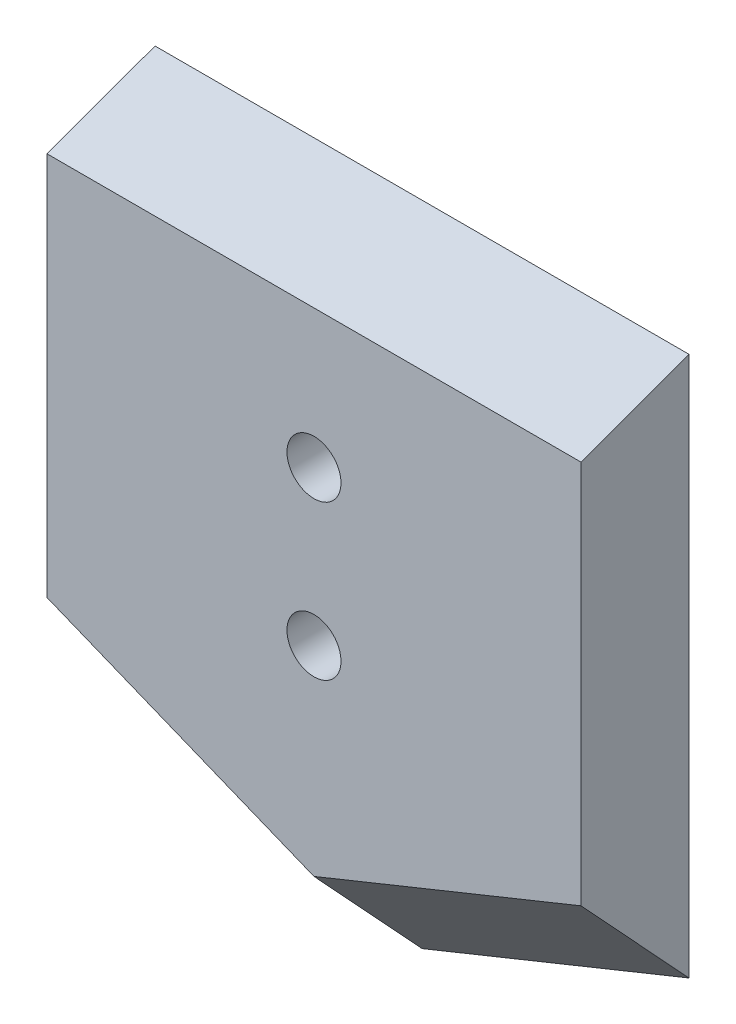
ISO-10303-21;
HEADER;
FILE_DESCRIPTION(('STEP AP214'),'2;1');
FILE_NAME('part.step','',(''),(''),'','','');
FILE_SCHEMA(('AUTOMOTIVE_DESIGN { 1 0 10303 214 1 1 1 1 }'));
ENDSEC;
DATA;
#1=APPLICATION_CONTEXT('core data for automotive mechanical design processes');
#2=APPLICATION_PROTOCOL_DEFINITION('international standard','automotive_design',2000,#1);
#3=PRODUCT_CONTEXT('',#1,'mechanical');
#4=PRODUCT('Part','Part','',(#3));
#5=PRODUCT_RELATED_PRODUCT_CATEGORY('part','',(#4));
#6=PRODUCT_DEFINITION_FORMATION('','',#4);
#7=PRODUCT_DEFINITION_CONTEXT('part definition',#1,'design');
#8=PRODUCT_DEFINITION('design','',#6,#7);
#9=PRODUCT_DEFINITION_SHAPE('','',#8);
#10=(LENGTH_UNIT() NAMED_UNIT(*) SI_UNIT(.MILLI.,.METRE.));
#11=(NAMED_UNIT(*) PLANE_ANGLE_UNIT() SI_UNIT($,.RADIAN.));
#12=(NAMED_UNIT(*) SI_UNIT($,.STERADIAN.) SOLID_ANGLE_UNIT());
#13=UNCERTAINTY_MEASURE_WITH_UNIT(LENGTH_MEASURE(1.E-05),#10,'distance_accuracy_value','');
#14=(GEOMETRIC_REPRESENTATION_CONTEXT(3) GLOBAL_UNCERTAINTY_ASSIGNED_CONTEXT((#13)) GLOBAL_UNIT_ASSIGNED_CONTEXT((#10,
#11,#12)) REPRESENTATION_CONTEXT('',''));
#15=CARTESIAN_POINT('',(0.,0.,0.));
#16=DIRECTION('',(0.,0.,1.));
#17=DIRECTION('',(1.,0.,0.));
#18=AXIS2_PLACEMENT_3D('',#15,#16,#17);
#19=CARTESIAN_POINT('',(0.,-6.,0.));
#20=DIRECTION('',(0.,0.,1.));
#21=DIRECTION('',(1.,0.,0.));
#22=AXIS2_PLACEMENT_3D('',#19,#20,#21);
#23=CYLINDRICAL_SURFACE('',#22,1.75);
#24=CARTESIAN_POINT('',(0.,-6.,7.));
#25=DIRECTION('',(0.,0.,1.));
#26=DIRECTION('',(-1.,0.,0.));
#27=AXIS2_PLACEMENT_3D('',#24,#25,#26);
#28=CIRCLE('',#27,1.75);
#29=CARTESIAN_POINT('',(-1.75,-6.,7.));
#30=VERTEX_POINT('',#29);
#31=EDGE_CURVE('E117',#30,#30,#28,.T.);
#32=ORIENTED_EDGE('',*,*,#31,.T.);
#33=EDGE_LOOP('',(#32));
#34=FACE_BOUND('',#33,.T.);
#35=CARTESIAN_POINT('',(0.,-6.,3.));
#36=DIRECTION('',(0.,0.,-1.));
#37=DIRECTION('',(-1.,0.,0.));
#38=AXIS2_PLACEMENT_3D('',#35,#36,#37);
#39=CIRCLE('',#38,1.75);
#40=CARTESIAN_POINT('',(-1.75,-6.,3.));
#41=VERTEX_POINT('',#40);
#42=EDGE_CURVE('E39',#41,#41,#39,.F.);
#43=ORIENTED_EDGE('',*,*,#42,.F.);
#44=EDGE_LOOP('',(#43));
#45=FACE_BOUND('',#44,.T.);
#46=ADVANCED_FACE('F35',(#34,#45),#23,.F.);
#47=CARTESIAN_POINT('',(0.,4.,0.));
#48=DIRECTION('',(0.,0.,1.));
#49=DIRECTION('',(1.,0.,0.));
#50=AXIS2_PLACEMENT_3D('',#47,#48,#49);
#51=CYLINDRICAL_SURFACE('',#50,1.75);
#52=CARTESIAN_POINT('',(0.,4.,7.));
#53=DIRECTION('',(0.,0.,1.));
#54=DIRECTION('',(-1.,0.,0.));
#55=AXIS2_PLACEMENT_3D('',#52,#53,#54);
#56=CIRCLE('',#55,1.75);
#57=CARTESIAN_POINT('',(-1.75,4.,7.));
#58=VERTEX_POINT('',#57);
#59=EDGE_CURVE('E121',#58,#58,#56,.T.);
#60=ORIENTED_EDGE('',*,*,#59,.T.);
#61=EDGE_LOOP('',(#60));
#62=FACE_BOUND('',#61,.T.);
#63=CARTESIAN_POINT('',(0.,4.,3.));
#64=DIRECTION('',(0.,0.,-1.));
#65=DIRECTION('',(-1.,0.,0.));
#66=AXIS2_PLACEMENT_3D('',#63,#64,#65);
#67=CIRCLE('',#66,1.75);
#68=CARTESIAN_POINT('',(-1.75,4.,3.));
#69=VERTEX_POINT('',#68);
#70=EDGE_CURVE('E119',#69,#69,#67,.F.);
#71=ORIENTED_EDGE('',*,*,#70,.F.);
#72=EDGE_LOOP('',(#71));
#73=FACE_BOUND('',#72,.T.);
#74=ADVANCED_FACE('F162',(#62,#73),#51,.F.);
#75=CARTESIAN_POINT('',(17.3,13.,7.));
#76=DIRECTION('',(-1.,0.,0.));
#77=DIRECTION('',(0.,0.,1.));
#78=AXIS2_PLACEMENT_3D('',#75,#76,#77);
#79=PLANE('',#78);
#80=DIRECTION('',(0.,1.,0.));
#81=VECTOR('',#80,1.);
#82=CARTESIAN_POINT('',(17.3,13.,0.));
#83=LINE('',#82,#81);
#84=CARTESIAN_POINT('',(17.3,-19.5,0.));
#85=VERTEX_POINT('',#84);
#86=CARTESIAN_POINT('',(17.3,15.5,0.));
#87=VERTEX_POINT('',#86);
#88=EDGE_CURVE('E94',#85,#87,#83,.T.);
#89=ORIENTED_EDGE('',*,*,#88,.T.);
#90=DIRECTION('',(0.,0.342020143325666,-0.939692620785909));
#91=VECTOR('',#90,1.);
#92=CARTESIAN_POINT('',(17.3,15.5,0.));
#93=LINE('',#92,#91);
#94=CARTESIAN_POINT('',(17.3,12.9522083601366,7.));
#95=VERTEX_POINT('',#94);
#96=EDGE_CURVE('E59',#87,#95,#93,.F.);
#97=ORIENTED_EDGE('',*,*,#96,.T.);
#98=DIRECTION('',(0.,1.,0.));
#99=VECTOR('',#98,1.);
#100=CARTESIAN_POINT('',(17.3,13.,7.));
#101=LINE('',#100,#99);
#102=CARTESIAN_POINT('',(17.3,-11.9486875651011,7.));
#103=VERTEX_POINT('',#102);
#104=EDGE_CURVE('E93',#103,#95,#101,.T.);
#105=ORIENTED_EDGE('',*,*,#104,.F.);
#106=DIRECTION('',(0.,0.733371095333155,0.679828534654032));
#107=VECTOR('',#106,1.);
#108=CARTESIAN_POINT('',(17.3,-19.5,0.));
#109=LINE('',#108,#107);
#110=EDGE_CURVE('E109',#103,#85,#109,.F.);
#111=ORIENTED_EDGE('',*,*,#110,.T.);
#112=EDGE_LOOP('',(#89,#97,#105,#111));
#113=FACE_BOUND('',#112,.T.);
#114=ADVANCED_FACE('F150',(#113),#79,.F.);
#115=CARTESIAN_POINT('',(-17.3,13.,7.));
#116=DIRECTION('',(1.,0.,0.));
#117=DIRECTION('',(0.,1.,0.));
#118=AXIS2_PLACEMENT_3D('',#115,#116,#117);
#119=PLANE('',#118);
#120=DIRECTION('',(0.,-1.,0.));
#121=VECTOR('',#120,1.);
#122=CARTESIAN_POINT('',(-17.3,13.,7.));
#123=LINE('',#122,#121);
#124=CARTESIAN_POINT('',(-17.3,12.9522083601366,7.));
#125=VERTEX_POINT('',#124);
#126=CARTESIAN_POINT('',(-17.3,-11.9486875651011,7.));
#127=VERTEX_POINT('',#126);
#128=EDGE_CURVE('E143',#125,#127,#123,.T.);
#129=ORIENTED_EDGE('',*,*,#128,.F.);
#130=DIRECTION('',(0.,-0.342020143325666,0.939692620785909));
#131=VECTOR('',#130,1.);
#132=CARTESIAN_POINT('',(-17.3,15.5,0.));
#133=LINE('',#132,#131);
#134=CARTESIAN_POINT('',(-17.3,15.5,0.));
#135=VERTEX_POINT('',#134);
#136=EDGE_CURVE('E11',#125,#135,#133,.F.);
#137=ORIENTED_EDGE('',*,*,#136,.T.);
#138=DIRECTION('',(0.,-1.,0.));
#139=VECTOR('',#138,1.);
#140=CARTESIAN_POINT('',(-17.3,13.,0.));
#141=LINE('',#140,#139);
#142=CARTESIAN_POINT('',(-17.3,-19.5,0.));
#143=VERTEX_POINT('',#142);
#144=EDGE_CURVE('E83',#135,#143,#141,.T.);
#145=ORIENTED_EDGE('',*,*,#144,.T.);
#146=DIRECTION('',(0.,-0.733371095333155,-0.679828534654032));
#147=VECTOR('',#146,1.);
#148=CARTESIAN_POINT('',(-17.3,-23.2648321442911,-3.48996617968573));
#149=LINE('',#148,#147);
#150=EDGE_CURVE('E87',#143,#127,#149,.F.);
#151=ORIENTED_EDGE('',*,*,#150,.T.);
#152=EDGE_LOOP('',(#129,#137,#145,#151));
#153=FACE_BOUND('',#152,.T.);
#154=ADVANCED_FACE('F85',(#153),#119,.F.);
#155=CARTESIAN_POINT('',(0.,0.,7.));
#156=DIRECTION('',(0.,0.,1.));
#157=DIRECTION('',(1.,0.,0.));
#158=AXIS2_PLACEMENT_3D('',#155,#156,#157);
#159=PLANE('',#158);
#160=ORIENTED_EDGE('',*,*,#59,.F.);
#161=EDGE_LOOP('',(#160));
#162=FACE_BOUND('',#161,.T.);
#163=ORIENTED_EDGE('',*,*,#31,.F.);
#164=EDGE_LOOP('',(#163));
#165=FACE_BOUND('',#164,.T.);
#166=ORIENTED_EDGE('',*,*,#104,.T.);
#167=DIRECTION('',(-1.,0.,0.));
#168=VECTOR('',#167,1.);
#169=CARTESIAN_POINT('',(0.,12.9522083601366,7.));
#170=LINE('',#169,#168);
#171=EDGE_CURVE('E44',#95,#125,#170,.T.);
#172=ORIENTED_EDGE('',*,*,#171,.T.);
#173=ORIENTED_EDGE('',*,*,#128,.T.);
#174=DIRECTION('',(0.926991176745522,-0.375083135099344,0.));
#175=VECTOR('',#174,1.);
#176=CARTESIAN_POINT('',(-6.5884351090578,-16.2828467695286,7.));
#177=LINE('',#176,#175);
#178=CARTESIAN_POINT('',(0.,-18.9486875651011,7.));
#179=VERTEX_POINT('',#178);
#180=EDGE_CURVE('E108',#127,#179,#177,.T.);
#181=ORIENTED_EDGE('',*,*,#180,.T.);
#182=DIRECTION('',(0.926991176745522,0.375083135099344,0.));
#183=VECTOR('',#182,1.);
#184=CARTESIAN_POINT('',(6.5884351090578,-16.2828467695286,7.));
#185=LINE('',#184,#183);
#186=EDGE_CURVE('E112',#179,#103,#185,.T.);
#187=ORIENTED_EDGE('',*,*,#186,.T.);
#188=EDGE_LOOP('',(#166,#172,#173,#181,#187));
#189=FACE_BOUND('',#188,.T.);
#190=ADVANCED_FACE('F147',(#162,#165,#189),#159,.T.);
#191=CARTESIAN_POINT('',(0.,0.,0.));
#192=DIRECTION('',(0.,0.,1.));
#193=DIRECTION('',(1.,0.,0.));
#194=AXIS2_PLACEMENT_3D('',#191,#192,#193);
#195=PLANE('',#194);
#196=CARTESIAN_POINT('',(0.,-6.,0.));
#197=DIRECTION('',(0.,0.,-1.));
#198=DIRECTION('',(-1.,0.,0.));
#199=AXIS2_PLACEMENT_3D('',#196,#197,#198);
#200=CIRCLE('',#199,3.5);
#201=CARTESIAN_POINT('',(-3.5,-6.,0.));
#202=VERTEX_POINT('',#201);
#203=EDGE_CURVE('E135',#202,#202,#200,.T.);
#204=ORIENTED_EDGE('',*,*,#203,.F.);
#205=EDGE_LOOP('',(#204));
#206=FACE_BOUND('',#205,.T.);
#207=CARTESIAN_POINT('',(0.,4.,0.));
#208=DIRECTION('',(0.,0.,-1.));
#209=DIRECTION('',(-1.,0.,0.));
#210=AXIS2_PLACEMENT_3D('',#207,#208,#209);
#211=CIRCLE('',#210,3.5);
#212=CARTESIAN_POINT('',(-3.5,4.,0.));
#213=VERTEX_POINT('',#212);
#214=EDGE_CURVE('E128',#213,#213,#211,.T.);
#215=ORIENTED_EDGE('',*,*,#214,.F.);
#216=EDGE_LOOP('',(#215));
#217=FACE_BOUND('',#216,.T.);
#218=ORIENTED_EDGE('',*,*,#88,.F.);
#219=DIRECTION('',(-0.926991176745522,-0.375083135099344,0.));
#220=VECTOR('',#219,1.);
#221=CARTESIAN_POINT('',(17.3,-19.5,0.));
#222=LINE('',#221,#220);
#223=CARTESIAN_POINT('',(0.,-26.5,0.));
#224=VERTEX_POINT('',#223);
#225=EDGE_CURVE('E102',#85,#224,#222,.T.);
#226=ORIENTED_EDGE('',*,*,#225,.T.);
#227=DIRECTION('',(-0.926991176745522,0.375083135099344,0.));
#228=VECTOR('',#227,1.);
#229=CARTESIAN_POINT('',(0.,-26.5,0.));
#230=LINE('',#229,#228);
#231=EDGE_CURVE('E98',#224,#143,#230,.T.);
#232=ORIENTED_EDGE('',*,*,#231,.T.);
#233=ORIENTED_EDGE('',*,*,#144,.F.);
#234=DIRECTION('',(1.,0.,0.));
#235=VECTOR('',#234,1.);
#236=CARTESIAN_POINT('',(17.3,15.5,0.));
#237=LINE('',#236,#235);
#238=EDGE_CURVE('E105',#135,#87,#237,.T.);
#239=ORIENTED_EDGE('',*,*,#238,.T.);
#240=EDGE_LOOP('',(#218,#226,#232,#233,#239));
#241=FACE_BOUND('',#240,.T.);
#242=ADVANCED_FACE('F100',(#206,#217,#241),#195,.F.);
#243=CARTESIAN_POINT('',(0.,-26.5,0.));
#244=DIRECTION('',(0.265223828337456,0.655481747176855,-0.707106781186549));
#245=DIRECTION('',(-0.926991176745522,0.375083135099344,0.));
#246=AXIS2_PLACEMENT_3D('',#243,#244,#245);
#247=PLANE('',#246);
#248=ORIENTED_EDGE('',*,*,#150,.F.);
#249=ORIENTED_EDGE('',*,*,#231,.F.);
#250=DIRECTION('',(0.,0.733371095333155,0.679828534654032));
#251=VECTOR('',#250,1.);
#252=CARTESIAN_POINT('',(0.,-26.5,0.));
#253=LINE('',#252,#251);
#254=EDGE_CURVE('E116',#179,#224,#253,.F.);
#255=ORIENTED_EDGE('',*,*,#254,.F.);
#256=ORIENTED_EDGE('',*,*,#180,.F.);
#257=EDGE_LOOP('',(#248,#249,#255,#256));
#258=FACE_BOUND('',#257,.T.);
#259=ADVANCED_FACE('F107',(#258),#247,.F.);
#260=CARTESIAN_POINT('',(17.3,-19.5,0.));
#261=DIRECTION('',(-0.265223828337456,0.655481747176855,-0.707106781186549));
#262=DIRECTION('',(-0.926991176745522,-0.375083135099344,0.));
#263=AXIS2_PLACEMENT_3D('',#260,#261,#262);
#264=PLANE('',#263);
#265=ORIENTED_EDGE('',*,*,#110,.F.);
#266=ORIENTED_EDGE('',*,*,#186,.F.);
#267=ORIENTED_EDGE('',*,*,#254,.T.);
#268=ORIENTED_EDGE('',*,*,#225,.F.);
#269=EDGE_LOOP('',(#265,#266,#267,#268));
#270=FACE_BOUND('',#269,.T.);
#271=ADVANCED_FACE('F151',(#270),#264,.F.);
#272=CARTESIAN_POINT('',(17.3,15.5,0.));
#273=DIRECTION('',(0.,-0.939692620785909,-0.342020143325666));
#274=DIRECTION('',(1.,0.,0.));
#275=AXIS2_PLACEMENT_3D('',#272,#273,#274);
#276=PLANE('',#275);
#277=ORIENTED_EDGE('',*,*,#136,.F.);
#278=ORIENTED_EDGE('',*,*,#171,.F.);
#279=ORIENTED_EDGE('',*,*,#96,.F.);
#280=ORIENTED_EDGE('',*,*,#238,.F.);
#281=EDGE_LOOP('',(#277,#278,#279,#280));
#282=FACE_BOUND('',#281,.T.);
#283=ADVANCED_FACE('F37',(#282),#276,.F.);
#284=CARTESIAN_POINT('',(0.,4.,3.));
#285=DIRECTION('',(0.,0.,-1.));
#286=DIRECTION('',(-1.,0.,0.));
#287=AXIS2_PLACEMENT_3D('',#284,#285,#286);
#288=PLANE('',#287);
#289=CARTESIAN_POINT('',(0.,4.,3.));
#290=DIRECTION('',(0.,0.,-1.));
#291=DIRECTION('',(-1.,0.,0.));
#292=AXIS2_PLACEMENT_3D('',#289,#290,#291);
#293=CIRCLE('',#292,3.5);
#294=CARTESIAN_POINT('',(-3.5,4.,3.));
#295=VERTEX_POINT('',#294);
#296=EDGE_CURVE('E122',#295,#295,#293,.T.);
#297=ORIENTED_EDGE('',*,*,#296,.T.);
#298=EDGE_LOOP('',(#297));
#299=FACE_BOUND('',#298,.T.);
#300=ORIENTED_EDGE('',*,*,#70,.T.);
#301=EDGE_LOOP('',(#300));
#302=FACE_BOUND('',#301,.T.);
#303=ADVANCED_FACE('F158',(#299,#302),#288,.T.);
#304=CARTESIAN_POINT('',(0.,4.,3.));
#305=DIRECTION('',(0.,0.,-1.));
#306=DIRECTION('',(-1.,0.,0.));
#307=AXIS2_PLACEMENT_3D('',#304,#305,#306);
#308=CYLINDRICAL_SURFACE('',#307,3.5);
#309=ORIENTED_EDGE('',*,*,#296,.F.);
#310=EDGE_LOOP('',(#309));
#311=FACE_BOUND('',#310,.T.);
#312=ORIENTED_EDGE('',*,*,#214,.T.);
#313=EDGE_LOOP('',(#312));
#314=FACE_BOUND('',#313,.T.);
#315=ADVANCED_FACE('F228',(#311,#314),#308,.F.);
#316=CARTESIAN_POINT('',(0.,-6.,3.));
#317=DIRECTION('',(0.,0.,-1.));
#318=DIRECTION('',(-1.,0.,0.));
#319=AXIS2_PLACEMENT_3D('',#316,#317,#318);
#320=PLANE('',#319);
#321=CARTESIAN_POINT('',(0.,-6.,3.));
#322=DIRECTION('',(0.,0.,-1.));
#323=DIRECTION('',(-1.,0.,0.));
#324=AXIS2_PLACEMENT_3D('',#321,#322,#323);
#325=CIRCLE('',#324,3.5);
#326=CARTESIAN_POINT('',(-3.5,-6.,3.));
#327=VERTEX_POINT('',#326);
#328=EDGE_CURVE('E263',#327,#327,#325,.T.);
#329=ORIENTED_EDGE('',*,*,#328,.T.);
#330=EDGE_LOOP('',(#329));
#331=FACE_BOUND('',#330,.T.);
#332=ORIENTED_EDGE('',*,*,#42,.T.);
#333=EDGE_LOOP('',(#332));
#334=FACE_BOUND('',#333,.T.);
#335=ADVANCED_FACE('F236',(#331,#334),#320,.T.);
#336=CARTESIAN_POINT('',(0.,-6.,3.));
#337=DIRECTION('',(0.,0.,-1.));
#338=DIRECTION('',(-1.,0.,0.));
#339=AXIS2_PLACEMENT_3D('',#336,#337,#338);
#340=CYLINDRICAL_SURFACE('',#339,3.5);
#341=ORIENTED_EDGE('',*,*,#328,.F.);
#342=EDGE_LOOP('',(#341));
#343=FACE_BOUND('',#342,.T.);
#344=ORIENTED_EDGE('',*,*,#203,.T.);
#345=EDGE_LOOP('',(#344));
#346=FACE_BOUND('',#345,.T.);
#347=ADVANCED_FACE('F244',(#343,#346),#340,.F.);
#348=CLOSED_SHELL('',(#46,#74,#114,#154,#190,#242,#259,#271,#283,#303,#315,#335,#347));
#349=MANIFOLD_SOLID_BREP('B2',#348);
#350=ADVANCED_BREP_SHAPE_REPRESENTATION('',(#18,#349),#14);
#351=SHAPE_DEFINITION_REPRESENTATION(#9,#350);
ENDSEC;
END-ISO-10303-21;
